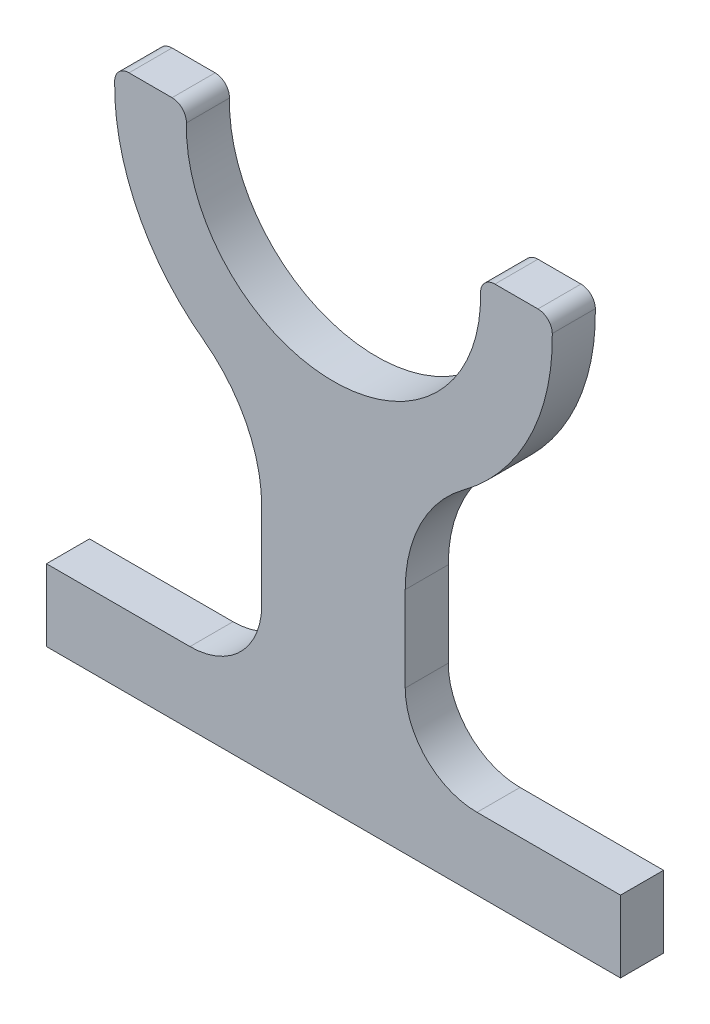
ISO-10303-21;
HEADER;
FILE_DESCRIPTION(('STEP AP214'),'2;1');
FILE_NAME('part.step','',(''),(''),'','','');
FILE_SCHEMA(('AUTOMOTIVE_DESIGN { 1 0 10303 214 1 1 1 1 }'));
ENDSEC;
DATA;
#1=APPLICATION_CONTEXT('core data for automotive mechanical design processes');
#2=APPLICATION_PROTOCOL_DEFINITION('international standard','automotive_design',2000,#1);
#3=PRODUCT_CONTEXT('',#1,'mechanical');
#4=PRODUCT('Part','Part','',(#3));
#5=PRODUCT_RELATED_PRODUCT_CATEGORY('part','',(#4));
#6=PRODUCT_DEFINITION_FORMATION('','',#4);
#7=PRODUCT_DEFINITION_CONTEXT('part definition',#1,'design');
#8=PRODUCT_DEFINITION('design','',#6,#7);
#9=PRODUCT_DEFINITION_SHAPE('','',#8);
#10=(LENGTH_UNIT() NAMED_UNIT(*) SI_UNIT(.MILLI.,.METRE.));
#11=(NAMED_UNIT(*) PLANE_ANGLE_UNIT() SI_UNIT($,.RADIAN.));
#12=(NAMED_UNIT(*) SI_UNIT($,.STERADIAN.) SOLID_ANGLE_UNIT());
#13=UNCERTAINTY_MEASURE_WITH_UNIT(LENGTH_MEASURE(1.E-05),#10,'distance_accuracy_value','');
#14=(GEOMETRIC_REPRESENTATION_CONTEXT(3) GLOBAL_UNCERTAINTY_ASSIGNED_CONTEXT((#13)) GLOBAL_UNIT_ASSIGNED_CONTEXT((#10,
#11,#12)) REPRESENTATION_CONTEXT('',''));
#15=CARTESIAN_POINT('',(0.,0.,0.));
#16=DIRECTION('',(0.,0.,1.));
#17=DIRECTION('',(1.,0.,0.));
#18=AXIS2_PLACEMENT_3D('',#15,#16,#17);
#19=CARTESIAN_POINT('',(-40.,10.,3.));
#20=DIRECTION('',(0.,-1.,0.));
#21=DIRECTION('',(0.,0.,-1.));
#22=AXIS2_PLACEMENT_3D('',#19,#20,#21);
#23=PLANE('',#22);
#24=DIRECTION('',(-1.,0.,0.));
#25=VECTOR('',#24,1.);
#26=CARTESIAN_POINT('',(-40.,10.,-3.));
#27=LINE('',#26,#25);
#28=CARTESIAN_POINT('',(-20.,10.,-3.));
#29=VERTEX_POINT('',#28);
#30=CARTESIAN_POINT('',(-40.,10.,-3.));
#31=VERTEX_POINT('',#30);
#32=EDGE_CURVE('E444',#29,#31,#27,.T.);
#33=ORIENTED_EDGE('',*,*,#32,.T.);
#34=DIRECTION('',(0.,0.,-1.));
#35=VECTOR('',#34,1.);
#36=CARTESIAN_POINT('',(-40.,10.,3.));
#37=LINE('',#36,#35);
#38=CARTESIAN_POINT('',(-40.,10.,3.));
#39=VERTEX_POINT('',#38);
#40=EDGE_CURVE('E12',#39,#31,#37,.T.);
#41=ORIENTED_EDGE('',*,*,#40,.F.);
#42=DIRECTION('',(-1.,0.,0.));
#43=VECTOR('',#42,1.);
#44=CARTESIAN_POINT('',(-40.,10.,3.));
#45=LINE('',#44,#43);
#46=CARTESIAN_POINT('',(-20.,10.,3.));
#47=VERTEX_POINT('',#46);
#48=EDGE_CURVE('E301',#47,#39,#45,.T.);
#49=ORIENTED_EDGE('',*,*,#48,.F.);
#50=DIRECTION('',(0.,0.,-1.));
#51=VECTOR('',#50,1.);
#52=CARTESIAN_POINT('',(-20.,10.,3.));
#53=LINE('',#52,#51);
#54=EDGE_CURVE('E213',#47,#29,#53,.T.);
#55=ORIENTED_EDGE('',*,*,#54,.T.);
#56=EDGE_LOOP('',(#33,#41,#49,#55));
#57=FACE_BOUND('',#56,.T.);
#58=ADVANCED_FACE('F43',(#57),#23,.F.);
#59=CARTESIAN_POINT('',(-40.,0.,3.));
#60=DIRECTION('',(1.,0.,0.));
#61=DIRECTION('',(0.,0.,-1.));
#62=AXIS2_PLACEMENT_3D('',#59,#60,#61);
#63=PLANE('',#62);
#64=DIRECTION('',(0.,-1.,0.));
#65=VECTOR('',#64,1.);
#66=CARTESIAN_POINT('',(-40.,0.,-3.));
#67=LINE('',#66,#65);
#68=CARTESIAN_POINT('',(-40.,0.,-3.));
#69=VERTEX_POINT('',#68);
#70=EDGE_CURVE('E431',#31,#69,#67,.T.);
#71=ORIENTED_EDGE('',*,*,#70,.T.);
#72=DIRECTION('',(0.,0.,-1.));
#73=VECTOR('',#72,1.);
#74=CARTESIAN_POINT('',(-40.,0.,3.));
#75=LINE('',#74,#73);
#76=CARTESIAN_POINT('',(-40.,0.,3.));
#77=VERTEX_POINT('',#76);
#78=EDGE_CURVE('E53',#77,#69,#75,.T.);
#79=ORIENTED_EDGE('',*,*,#78,.F.);
#80=DIRECTION('',(0.,-1.,0.));
#81=VECTOR('',#80,1.);
#82=CARTESIAN_POINT('',(-40.,0.,3.));
#83=LINE('',#82,#81);
#84=EDGE_CURVE('E140',#39,#77,#83,.T.);
#85=ORIENTED_EDGE('',*,*,#84,.F.);
#86=ORIENTED_EDGE('',*,*,#40,.T.);
#87=EDGE_LOOP('',(#71,#79,#85,#86));
#88=FACE_BOUND('',#87,.T.);
#89=ADVANCED_FACE('F449',(#88),#63,.F.);
#90=CARTESIAN_POINT('',(-40.,0.,3.));
#91=DIRECTION('',(0.,1.,0.));
#92=DIRECTION('',(-1.,0.,0.));
#93=AXIS2_PLACEMENT_3D('',#90,#91,#92);
#94=PLANE('',#93);
#95=DIRECTION('',(1.,0.,0.));
#96=VECTOR('',#95,1.);
#97=CARTESIAN_POINT('',(-40.,0.,-3.));
#98=LINE('',#97,#96);
#99=CARTESIAN_POINT('',(40.,0.,-3.));
#100=VERTEX_POINT('',#99);
#101=EDGE_CURVE('E422',#69,#100,#98,.T.);
#102=ORIENTED_EDGE('',*,*,#101,.T.);
#103=DIRECTION('',(0.,0.,-1.));
#104=VECTOR('',#103,1.);
#105=CARTESIAN_POINT('',(40.,0.,3.));
#106=LINE('',#105,#104);
#107=CARTESIAN_POINT('',(40.,0.,3.));
#108=VERTEX_POINT('',#107);
#109=EDGE_CURVE('E398',#108,#100,#106,.T.);
#110=ORIENTED_EDGE('',*,*,#109,.F.);
#111=DIRECTION('',(1.,0.,0.));
#112=VECTOR('',#111,1.);
#113=CARTESIAN_POINT('',(-40.,0.,3.));
#114=LINE('',#113,#112);
#115=EDGE_CURVE('E290',#77,#108,#114,.T.);
#116=ORIENTED_EDGE('',*,*,#115,.F.);
#117=ORIENTED_EDGE('',*,*,#78,.T.);
#118=EDGE_LOOP('',(#102,#110,#116,#117));
#119=FACE_BOUND('',#118,.T.);
#120=ADVANCED_FACE('F451',(#119),#94,.F.);
#121=CARTESIAN_POINT('',(40.,0.,3.));
#122=DIRECTION('',(-1.,0.,0.));
#123=DIRECTION('',(0.,0.,1.));
#124=AXIS2_PLACEMENT_3D('',#121,#122,#123);
#125=PLANE('',#124);
#126=DIRECTION('',(0.,1.,0.));
#127=VECTOR('',#126,1.);
#128=CARTESIAN_POINT('',(40.,0.,-3.));
#129=LINE('',#128,#127);
#130=CARTESIAN_POINT('',(40.,10.,-3.));
#131=VERTEX_POINT('',#130);
#132=EDGE_CURVE('E417',#100,#131,#129,.T.);
#133=ORIENTED_EDGE('',*,*,#132,.T.);
#134=DIRECTION('',(0.,0.,-1.));
#135=VECTOR('',#134,1.);
#136=CARTESIAN_POINT('',(40.,10.,3.));
#137=LINE('',#136,#135);
#138=CARTESIAN_POINT('',(40.,10.,3.));
#139=VERTEX_POINT('',#138);
#140=EDGE_CURVE('E393',#139,#131,#137,.T.);
#141=ORIENTED_EDGE('',*,*,#140,.F.);
#142=DIRECTION('',(0.,1.,0.));
#143=VECTOR('',#142,1.);
#144=CARTESIAN_POINT('',(40.,0.,3.));
#145=LINE('',#144,#143);
#146=EDGE_CURVE('E286',#108,#139,#145,.T.);
#147=ORIENTED_EDGE('',*,*,#146,.F.);
#148=ORIENTED_EDGE('',*,*,#109,.T.);
#149=EDGE_LOOP('',(#133,#141,#147,#148));
#150=FACE_BOUND('',#149,.T.);
#151=ADVANCED_FACE('F415',(#150),#125,.F.);
#152=CARTESIAN_POINT('',(40.,10.,3.));
#153=DIRECTION('',(0.,-1.,0.));
#154=DIRECTION('',(1.,0.,0.));
#155=AXIS2_PLACEMENT_3D('',#152,#153,#154);
#156=PLANE('',#155);
#157=DIRECTION('',(-1.,0.,0.));
#158=VECTOR('',#157,1.);
#159=CARTESIAN_POINT('',(40.,10.,-3.));
#160=LINE('',#159,#158);
#161=CARTESIAN_POINT('',(20.,10.,-3.));
#162=VERTEX_POINT('',#161);
#163=EDGE_CURVE('E424',#131,#162,#160,.T.);
#164=ORIENTED_EDGE('',*,*,#163,.T.);
#165=DIRECTION('',(0.,0.,-1.));
#166=VECTOR('',#165,1.);
#167=CARTESIAN_POINT('',(20.,10.,3.));
#168=LINE('',#167,#166);
#169=CARTESIAN_POINT('',(20.,10.,3.));
#170=VERTEX_POINT('',#169);
#171=EDGE_CURVE('E388',#170,#162,#168,.T.);
#172=ORIENTED_EDGE('',*,*,#171,.F.);
#173=DIRECTION('',(-1.,0.,0.));
#174=VECTOR('',#173,1.);
#175=CARTESIAN_POINT('',(40.,10.,3.));
#176=LINE('',#175,#174);
#177=EDGE_CURVE('E283',#139,#170,#176,.T.);
#178=ORIENTED_EDGE('',*,*,#177,.F.);
#179=ORIENTED_EDGE('',*,*,#140,.T.);
#180=EDGE_LOOP('',(#164,#172,#178,#179));
#181=FACE_BOUND('',#180,.T.);
#182=ADVANCED_FACE('F460',(#181),#156,.F.);
#183=CARTESIAN_POINT('',(20.,20.,3.));
#184=DIRECTION('',(0.,0.,-1.));
#185=DIRECTION('',(-1.,0.,0.));
#186=AXIS2_PLACEMENT_3D('',#183,#184,#185);
#187=CYLINDRICAL_SURFACE('',#186,10.);
#188=CARTESIAN_POINT('',(20.,20.,-3.));
#189=DIRECTION('',(0.,0.,-1.));
#190=DIRECTION('',(-1.,0.,0.));
#191=AXIS2_PLACEMENT_3D('',#188,#189,#190);
#192=CIRCLE('',#191,10.);
#193=CARTESIAN_POINT('',(10.,20.,-3.));
#194=VERTEX_POINT('',#193);
#195=EDGE_CURVE('E429',#162,#194,#192,.T.);
#196=ORIENTED_EDGE('',*,*,#195,.T.);
#197=DIRECTION('',(0.,0.,-1.));
#198=VECTOR('',#197,1.);
#199=CARTESIAN_POINT('',(10.,20.,3.));
#200=LINE('',#199,#198);
#201=CARTESIAN_POINT('',(10.,20.,3.));
#202=VERTEX_POINT('',#201);
#203=EDGE_CURVE('E384',#202,#194,#200,.T.);
#204=ORIENTED_EDGE('',*,*,#203,.F.);
#205=CARTESIAN_POINT('',(20.,20.,3.));
#206=DIRECTION('',(0.,0.,-1.));
#207=DIRECTION('',(-1.,0.,0.));
#208=AXIS2_PLACEMENT_3D('',#205,#206,#207);
#209=CIRCLE('',#208,10.);
#210=EDGE_CURVE('E275',#170,#202,#209,.T.);
#211=ORIENTED_EDGE('',*,*,#210,.F.);
#212=ORIENTED_EDGE('',*,*,#171,.T.);
#213=EDGE_LOOP('',(#196,#204,#211,#212));
#214=FACE_BOUND('',#213,.T.);
#215=ADVANCED_FACE('F463',(#214),#187,.F.);
#216=CARTESIAN_POINT('',(10.,20.,3.));
#217=DIRECTION('',(-1.,0.,0.));
#218=DIRECTION('',(0.,-1.,0.));
#219=AXIS2_PLACEMENT_3D('',#216,#217,#218);
#220=PLANE('',#219);
#221=DIRECTION('',(0.,1.,0.));
#222=VECTOR('',#221,1.);
#223=CARTESIAN_POINT('',(10.,20.,-3.));
#224=LINE('',#223,#222);
#225=CARTESIAN_POINT('',(10.,31.876730806101,-3.));
#226=VERTEX_POINT('',#225);
#227=EDGE_CURVE('E734',#194,#226,#224,.T.);
#228=ORIENTED_EDGE('',*,*,#227,.T.);
#229=DIRECTION('',(0.,0.,-1.));
#230=VECTOR('',#229,1.);
#231=CARTESIAN_POINT('',(10.,31.876730806101,3.));
#232=LINE('',#231,#230);
#233=CARTESIAN_POINT('',(10.,31.876730806101,3.));
#234=VERTEX_POINT('',#233);
#235=EDGE_CURVE('E376',#234,#226,#232,.T.);
#236=ORIENTED_EDGE('',*,*,#235,.F.);
#237=DIRECTION('',(0.,1.,0.));
#238=VECTOR('',#237,1.);
#239=CARTESIAN_POINT('',(10.,20.,3.));
#240=LINE('',#239,#238);
#241=EDGE_CURVE('E271',#202,#234,#240,.T.);
#242=ORIENTED_EDGE('',*,*,#241,.F.);
#243=ORIENTED_EDGE('',*,*,#203,.T.);
#244=EDGE_LOOP('',(#228,#236,#242,#243));
#245=FACE_BOUND('',#244,.T.);
#246=ADVANCED_FACE('F467',(#245),#220,.F.);
#247=CARTESIAN_POINT('',(30.,31.876730806101,3.));
#248=DIRECTION('',(0.,0.,-1.));
#249=DIRECTION('',(-1.,0.,0.));
#250=AXIS2_PLACEMENT_3D('',#247,#248,#249);
#251=CYLINDRICAL_SURFACE('',#250,20.);
#252=CARTESIAN_POINT('',(30.,31.876730806101,-3.));
#253=DIRECTION('',(0.,0.,-1.));
#254=DIRECTION('',(-1.,0.,0.));
#255=AXIS2_PLACEMENT_3D('',#252,#253,#254);
#256=CIRCLE('',#255,20.);
#257=CARTESIAN_POINT('',(18.1188118811881,47.9651542492294,-3.));
#258=VERTEX_POINT('',#257);
#259=EDGE_CURVE('E731',#226,#258,#256,.T.);
#260=ORIENTED_EDGE('',*,*,#259,.T.);
#261=DIRECTION('',(0.,0.,-1.));
#262=VECTOR('',#261,1.);
#263=CARTESIAN_POINT('',(18.1188118811881,47.9651542492294,3.));
#264=LINE('',#263,#262);
#265=CARTESIAN_POINT('',(18.1188118811881,47.9651542492294,3.));
#266=VERTEX_POINT('',#265);
#267=EDGE_CURVE('E371',#266,#258,#264,.T.);
#268=ORIENTED_EDGE('',*,*,#267,.F.);
#269=CARTESIAN_POINT('',(30.,31.876730806101,3.));
#270=DIRECTION('',(0.,0.,-1.));
#271=DIRECTION('',(-1.,0.,0.));
#272=AXIS2_PLACEMENT_3D('',#269,#270,#271);
#273=CIRCLE('',#272,20.);
#274=EDGE_CURVE('E267',#234,#266,#273,.T.);
#275=ORIENTED_EDGE('',*,*,#274,.F.);
#276=ORIENTED_EDGE('',*,*,#235,.T.);
#277=EDGE_LOOP('',(#260,#268,#275,#276));
#278=FACE_BOUND('',#277,.T.);
#279=ADVANCED_FACE('F471',(#278),#251,.F.);
#280=CARTESIAN_POINT('',(0.,72.5,3.));
#281=DIRECTION('',(0.,0.,-1.));
#282=DIRECTION('',(-1.,0.,0.));
#283=AXIS2_PLACEMENT_3D('',#280,#281,#282);
#284=CYLINDRICAL_SURFACE('',#283,30.4999999999998);
#285=CARTESIAN_POINT('',(0.,72.5,-3.));
#286=DIRECTION('',(0.,0.,1.));
#287=DIRECTION('',(1.,0.,0.));
#288=AXIS2_PLACEMENT_3D('',#285,#286,#287);
#289=CIRCLE('',#288,30.4999999999998);
#290=CARTESIAN_POINT('',(30.4953058868516,73.0350877192982,-3.));
#291=VERTEX_POINT('',#290);
#292=EDGE_CURVE('E724',#258,#291,#289,.T.);
#293=ORIENTED_EDGE('',*,*,#292,.T.);
#294=DIRECTION('',(0.,0.,-1.));
#295=VECTOR('',#294,1.);
#296=CARTESIAN_POINT('',(30.4953058868516,73.0350877192982,3.));
#297=LINE('',#296,#295);
#298=CARTESIAN_POINT('',(30.4953058868516,73.0350877192982,3.));
#299=VERTEX_POINT('',#298);
#300=EDGE_CURVE('E366',#299,#291,#297,.T.);
#301=ORIENTED_EDGE('',*,*,#300,.F.);
#302=CARTESIAN_POINT('',(0.,72.5,3.));
#303=DIRECTION('',(0.,0.,1.));
#304=DIRECTION('',(1.,0.,0.));
#305=AXIS2_PLACEMENT_3D('',#302,#303,#304);
#306=CIRCLE('',#305,30.4999999999998);
#307=EDGE_CURVE('E264',#266,#299,#306,.T.);
#308=ORIENTED_EDGE('',*,*,#307,.F.);
#309=ORIENTED_EDGE('',*,*,#267,.T.);
#310=EDGE_LOOP('',(#293,#301,#308,#309));
#311=FACE_BOUND('',#310,.T.);
#312=ADVANCED_FACE('F475',(#311),#284,.T.);
#313=CARTESIAN_POINT('',(28.4956136975498,73.,3.));
#314=DIRECTION('',(0.,0.,-1.));
#315=DIRECTION('',(-1.,0.,0.));
#316=AXIS2_PLACEMENT_3D('',#313,#314,#315);
#317=CYLINDRICAL_SURFACE('',#316,2.);
#318=CARTESIAN_POINT('',(28.4956136975498,73.,-3.));
#319=DIRECTION('',(0.,0.,1.));
#320=DIRECTION('',(1.,0.,0.));
#321=AXIS2_PLACEMENT_3D('',#318,#319,#320);
#322=CIRCLE('',#321,2.);
#323=CARTESIAN_POINT('',(28.4956136975498,75.,-3.));
#324=VERTEX_POINT('',#323);
#325=EDGE_CURVE('E720',#291,#324,#322,.T.);
#326=ORIENTED_EDGE('',*,*,#325,.T.);
#327=DIRECTION('',(0.,0.,-1.));
#328=VECTOR('',#327,1.);
#329=CARTESIAN_POINT('',(28.4956136975498,75.,3.));
#330=LINE('',#329,#328);
#331=CARTESIAN_POINT('',(28.4956136975498,75.,3.));
#332=VERTEX_POINT('',#331);
#333=EDGE_CURVE('E362',#332,#324,#330,.T.);
#334=ORIENTED_EDGE('',*,*,#333,.F.);
#335=CARTESIAN_POINT('',(28.4956136975498,73.,3.));
#336=DIRECTION('',(0.,0.,1.));
#337=DIRECTION('',(1.,0.,0.));
#338=AXIS2_PLACEMENT_3D('',#335,#336,#337);
#339=CIRCLE('',#338,2.);
#340=EDGE_CURVE('E256',#299,#332,#339,.T.);
#341=ORIENTED_EDGE('',*,*,#340,.F.);
#342=ORIENTED_EDGE('',*,*,#300,.T.);
#343=EDGE_LOOP('',(#326,#334,#341,#342));
#344=FACE_BOUND('',#343,.T.);
#345=ADVANCED_FACE('F479',(#344),#317,.T.);
#346=CARTESIAN_POINT('',(28.4956136975498,75.,3.));
#347=DIRECTION('',(0.,-1.,0.));
#348=DIRECTION('',(0.,0.,-1.));
#349=AXIS2_PLACEMENT_3D('',#346,#347,#348);
#350=PLANE('',#349);
#351=DIRECTION('',(-1.,0.,0.));
#352=VECTOR('',#351,1.);
#353=CARTESIAN_POINT('',(28.4956136975498,75.,-3.));
#354=LINE('',#353,#352);
#355=CARTESIAN_POINT('',(22.494443758404,75.,-3.));
#356=VERTEX_POINT('',#355);
#357=EDGE_CURVE('E716',#324,#356,#354,.T.);
#358=ORIENTED_EDGE('',*,*,#357,.T.);
#359=DIRECTION('',(0.,0.,-1.));
#360=VECTOR('',#359,1.);
#361=CARTESIAN_POINT('',(22.494443758404,75.,3.));
#362=LINE('',#361,#360);
#363=CARTESIAN_POINT('',(22.494443758404,75.,3.));
#364=VERTEX_POINT('',#363);
#365=EDGE_CURVE('E354',#364,#356,#362,.T.);
#366=ORIENTED_EDGE('',*,*,#365,.F.);
#367=DIRECTION('',(-1.,0.,0.));
#368=VECTOR('',#367,1.);
#369=CARTESIAN_POINT('',(28.4956136975498,75.,3.));
#370=LINE('',#369,#368);
#371=EDGE_CURVE('E252',#332,#364,#370,.T.);
#372=ORIENTED_EDGE('',*,*,#371,.F.);
#373=ORIENTED_EDGE('',*,*,#333,.T.);
#374=EDGE_LOOP('',(#358,#366,#372,#373));
#375=FACE_BOUND('',#374,.T.);
#376=ADVANCED_FACE('F483',(#375),#350,.F.);
#377=CARTESIAN_POINT('',(22.494443758404,73.,3.));
#378=DIRECTION('',(0.,0.,-1.));
#379=DIRECTION('',(-1.,0.,0.));
#380=AXIS2_PLACEMENT_3D('',#377,#378,#379);
#381=CYLINDRICAL_SURFACE('',#380,2.);
#382=CARTESIAN_POINT('',(22.494443758404,73.,-3.));
#383=DIRECTION('',(0.,0.,1.));
#384=DIRECTION('',(1.,0.,0.));
#385=AXIS2_PLACEMENT_3D('',#382,#383,#384);
#386=CIRCLE('',#385,2.);
#387=CARTESIAN_POINT('',(20.4949376465459,72.9555555555556,-3.));
#388=VERTEX_POINT('',#387);
#389=EDGE_CURVE('E713',#356,#388,#386,.T.);
#390=ORIENTED_EDGE('',*,*,#389,.T.);
#391=DIRECTION('',(0.,0.,-1.));
#392=VECTOR('',#391,1.);
#393=CARTESIAN_POINT('',(20.4949376465459,72.9555555555556,3.));
#394=LINE('',#393,#392);
#395=CARTESIAN_POINT('',(20.4949376465459,72.9555555555556,3.));
#396=VERTEX_POINT('',#395);
#397=EDGE_CURVE('E349',#396,#388,#394,.T.);
#398=ORIENTED_EDGE('',*,*,#397,.F.);
#399=CARTESIAN_POINT('',(22.494443758404,73.,3.));
#400=DIRECTION('',(0.,0.,1.));
#401=DIRECTION('',(1.,0.,0.));
#402=AXIS2_PLACEMENT_3D('',#399,#400,#401);
#403=CIRCLE('',#402,2.);
#404=EDGE_CURVE('E248',#364,#396,#403,.T.);
#405=ORIENTED_EDGE('',*,*,#404,.F.);
#406=ORIENTED_EDGE('',*,*,#365,.T.);
#407=EDGE_LOOP('',(#390,#398,#405,#406));
#408=FACE_BOUND('',#407,.T.);
#409=ADVANCED_FACE('F487',(#408),#381,.T.);
#410=CARTESIAN_POINT('',(0.,72.5,3.));
#411=DIRECTION('',(0.,0.,-1.));
#412=DIRECTION('',(-1.,0.,0.));
#413=AXIS2_PLACEMENT_3D('',#410,#411,#412);
#414=CYLINDRICAL_SURFACE('',#413,20.5);
#415=CARTESIAN_POINT('',(0.,72.5,-3.));
#416=DIRECTION('',(0.,0.,-1.));
#417=DIRECTION('',(1.,0.,0.));
#418=AXIS2_PLACEMENT_3D('',#415,#416,#417);
#419=CIRCLE('',#418,20.5);
#420=CARTESIAN_POINT('',(-20.4949376465459,72.9555555555555,-3.));
#421=VERTEX_POINT('',#420);
#422=EDGE_CURVE('E705',#388,#421,#419,.T.);
#423=ORIENTED_EDGE('',*,*,#422,.T.);
#424=DIRECTION('',(0.,0.,-1.));
#425=VECTOR('',#424,1.);
#426=CARTESIAN_POINT('',(-20.4949376465459,72.9555555555555,3.));
#427=LINE('',#426,#425);
#428=CARTESIAN_POINT('',(-20.4949376465459,72.9555555555555,3.));
#429=VERTEX_POINT('',#428);
#430=EDGE_CURVE('E344',#429,#421,#427,.T.);
#431=ORIENTED_EDGE('',*,*,#430,.F.);
#432=CARTESIAN_POINT('',(0.,72.5,3.));
#433=DIRECTION('',(0.,0.,-1.));
#434=DIRECTION('',(1.,0.,0.));
#435=AXIS2_PLACEMENT_3D('',#432,#433,#434);
#436=CIRCLE('',#435,20.5);
#437=EDGE_CURVE('E245',#396,#429,#436,.T.);
#438=ORIENTED_EDGE('',*,*,#437,.F.);
#439=ORIENTED_EDGE('',*,*,#397,.T.);
#440=EDGE_LOOP('',(#423,#431,#438,#439));
#441=FACE_BOUND('',#440,.T.);
#442=ADVANCED_FACE('F491',(#441),#414,.F.);
#443=CARTESIAN_POINT('',(-22.494443758404,73.,3.));
#444=DIRECTION('',(0.,0.,-1.));
#445=DIRECTION('',(-1.,0.,0.));
#446=AXIS2_PLACEMENT_3D('',#443,#444,#445);
#447=CYLINDRICAL_SURFACE('',#446,2.);
#448=CARTESIAN_POINT('',(-22.494443758404,73.,-3.));
#449=DIRECTION('',(0.,0.,1.));
#450=DIRECTION('',(1.,0.,0.));
#451=AXIS2_PLACEMENT_3D('',#448,#449,#450);
#452=CIRCLE('',#451,2.);
#453=CARTESIAN_POINT('',(-22.494443758404,75.,-3.));
#454=VERTEX_POINT('',#453);
#455=EDGE_CURVE('E701',#421,#454,#452,.T.);
#456=ORIENTED_EDGE('',*,*,#455,.T.);
#457=DIRECTION('',(0.,0.,-1.));
#458=VECTOR('',#457,1.);
#459=CARTESIAN_POINT('',(-22.494443758404,75.,3.));
#460=LINE('',#459,#458);
#461=CARTESIAN_POINT('',(-22.494443758404,75.,3.));
#462=VERTEX_POINT('',#461);
#463=EDGE_CURVE('E340',#462,#454,#460,.T.);
#464=ORIENTED_EDGE('',*,*,#463,.F.);
#465=CARTESIAN_POINT('',(-22.494443758404,73.,3.));
#466=DIRECTION('',(0.,0.,1.));
#467=DIRECTION('',(1.,0.,0.));
#468=AXIS2_PLACEMENT_3D('',#465,#466,#467);
#469=CIRCLE('',#468,2.);
#470=EDGE_CURVE('E237',#429,#462,#469,.T.);
#471=ORIENTED_EDGE('',*,*,#470,.F.);
#472=ORIENTED_EDGE('',*,*,#430,.T.);
#473=EDGE_LOOP('',(#456,#464,#471,#472));
#474=FACE_BOUND('',#473,.T.);
#475=ADVANCED_FACE('F495',(#474),#447,.T.);
#476=CARTESIAN_POINT('',(-22.494443758404,75.,3.));
#477=DIRECTION('',(0.,-1.,0.));
#478=DIRECTION('',(0.,0.,-1.));
#479=AXIS2_PLACEMENT_3D('',#476,#477,#478);
#480=PLANE('',#479);
#481=DIRECTION('',(-1.,0.,0.));
#482=VECTOR('',#481,1.);
#483=CARTESIAN_POINT('',(-22.494443758404,75.,-3.));
#484=LINE('',#483,#482);
#485=CARTESIAN_POINT('',(-28.4956136975498,75.,-3.));
#486=VERTEX_POINT('',#485);
#487=EDGE_CURVE('E697',#454,#486,#484,.T.);
#488=ORIENTED_EDGE('',*,*,#487,.T.);
#489=DIRECTION('',(0.,0.,-1.));
#490=VECTOR('',#489,1.);
#491=CARTESIAN_POINT('',(-28.4956136975498,75.,3.));
#492=LINE('',#491,#490);
#493=CARTESIAN_POINT('',(-28.4956136975498,75.,3.));
#494=VERTEX_POINT('',#493);
#495=EDGE_CURVE('E332',#494,#486,#492,.T.);
#496=ORIENTED_EDGE('',*,*,#495,.F.);
#497=DIRECTION('',(-1.,0.,0.));
#498=VECTOR('',#497,1.);
#499=CARTESIAN_POINT('',(-22.494443758404,75.,3.));
#500=LINE('',#499,#498);
#501=EDGE_CURVE('E233',#462,#494,#500,.T.);
#502=ORIENTED_EDGE('',*,*,#501,.F.);
#503=ORIENTED_EDGE('',*,*,#463,.T.);
#504=EDGE_LOOP('',(#488,#496,#502,#503));
#505=FACE_BOUND('',#504,.T.);
#506=ADVANCED_FACE('F499',(#505),#480,.F.);
#507=CARTESIAN_POINT('',(-28.4956136975498,73.,3.));
#508=DIRECTION('',(0.,0.,-1.));
#509=DIRECTION('',(-1.,0.,0.));
#510=AXIS2_PLACEMENT_3D('',#507,#508,#509);
#511=CYLINDRICAL_SURFACE('',#510,2.);
#512=CARTESIAN_POINT('',(-28.4956136975498,73.,-3.));
#513=DIRECTION('',(0.,0.,1.));
#514=DIRECTION('',(-1.,0.,0.));
#515=AXIS2_PLACEMENT_3D('',#512,#513,#514);
#516=CIRCLE('',#515,2.);
#517=CARTESIAN_POINT('',(-30.4953058868516,73.0350877192982,-3.));
#518=VERTEX_POINT('',#517);
#519=EDGE_CURVE('E683',#486,#518,#516,.T.);
#520=ORIENTED_EDGE('',*,*,#519,.T.);
#521=DIRECTION('',(0.,0.,-1.));
#522=VECTOR('',#521,1.);
#523=CARTESIAN_POINT('',(-30.4953058868516,73.0350877192982,3.));
#524=LINE('',#523,#522);
#525=CARTESIAN_POINT('',(-30.4953058868516,73.0350877192982,3.));
#526=VERTEX_POINT('',#525);
#527=EDGE_CURVE('E327',#526,#518,#524,.T.);
#528=ORIENTED_EDGE('',*,*,#527,.F.);
#529=CARTESIAN_POINT('',(-28.4956136975498,73.,3.));
#530=DIRECTION('',(0.,0.,1.));
#531=DIRECTION('',(-1.,0.,0.));
#532=AXIS2_PLACEMENT_3D('',#529,#530,#531);
#533=CIRCLE('',#532,2.);
#534=EDGE_CURVE('E229',#494,#526,#533,.T.);
#535=ORIENTED_EDGE('',*,*,#534,.F.);
#536=ORIENTED_EDGE('',*,*,#495,.T.);
#537=EDGE_LOOP('',(#520,#528,#535,#536));
#538=FACE_BOUND('',#537,.T.);
#539=ADVANCED_FACE('F503',(#538),#511,.T.);
#540=CARTESIAN_POINT('',(0.,72.5,3.));
#541=DIRECTION('',(0.,0.,-1.));
#542=DIRECTION('',(-1.,0.,0.));
#543=AXIS2_PLACEMENT_3D('',#540,#541,#542);
#544=CYLINDRICAL_SURFACE('',#543,30.4999999999998);
#545=CARTESIAN_POINT('',(0.,72.5,-3.));
#546=DIRECTION('',(0.,0.,1.));
#547=DIRECTION('',(-1.,0.,0.));
#548=AXIS2_PLACEMENT_3D('',#545,#546,#547);
#549=CIRCLE('',#548,30.4999999999998);
#550=CARTESIAN_POINT('',(-18.1188118811881,47.9651542492294,-3.));
#551=VERTEX_POINT('',#550);
#552=EDGE_CURVE('E679',#518,#551,#549,.T.);
#553=ORIENTED_EDGE('',*,*,#552,.T.);
#554=DIRECTION('',(0.,0.,-1.));
#555=VECTOR('',#554,1.);
#556=CARTESIAN_POINT('',(-18.1188118811881,47.9651542492294,3.));
#557=LINE('',#556,#555);
#558=CARTESIAN_POINT('',(-18.1188118811881,47.9651542492294,3.));
#559=VERTEX_POINT('',#558);
#560=EDGE_CURVE('E206',#559,#551,#557,.T.);
#561=ORIENTED_EDGE('',*,*,#560,.F.);
#562=CARTESIAN_POINT('',(0.,72.5,3.));
#563=DIRECTION('',(0.,0.,1.));
#564=DIRECTION('',(-1.,0.,0.));
#565=AXIS2_PLACEMENT_3D('',#562,#563,#564);
#566=CIRCLE('',#565,30.4999999999998);
#567=EDGE_CURVE('E195',#526,#559,#566,.T.);
#568=ORIENTED_EDGE('',*,*,#567,.F.);
#569=ORIENTED_EDGE('',*,*,#527,.T.);
#570=EDGE_LOOP('',(#553,#561,#568,#569));
#571=FACE_BOUND('',#570,.T.);
#572=ADVANCED_FACE('F507',(#571),#544,.T.);
#573=CARTESIAN_POINT('',(-30.,31.876730806101,3.));
#574=DIRECTION('',(0.,0.,-1.));
#575=DIRECTION('',(-1.,0.,0.));
#576=AXIS2_PLACEMENT_3D('',#573,#574,#575);
#577=CYLINDRICAL_SURFACE('',#576,20.);
#578=CARTESIAN_POINT('',(-30.,31.876730806101,-3.));
#579=DIRECTION('',(0.,0.,-1.));
#580=DIRECTION('',(1.,0.,0.));
#581=AXIS2_PLACEMENT_3D('',#578,#579,#580);
#582=CIRCLE('',#581,20.);
#583=CARTESIAN_POINT('',(-10.,31.876730806101,-3.));
#584=VERTEX_POINT('',#583);
#585=EDGE_CURVE('E204',#551,#584,#582,.T.);
#586=ORIENTED_EDGE('',*,*,#585,.T.);
#587=DIRECTION('',(0.,0.,-1.));
#588=VECTOR('',#587,1.);
#589=CARTESIAN_POINT('',(-10.,31.876730806101,3.));
#590=LINE('',#589,#588);
#591=CARTESIAN_POINT('',(-10.,31.876730806101,3.));
#592=VERTEX_POINT('',#591);
#593=EDGE_CURVE('E201',#592,#584,#590,.T.);
#594=ORIENTED_EDGE('',*,*,#593,.F.);
#595=CARTESIAN_POINT('',(-30.,31.876730806101,3.));
#596=DIRECTION('',(0.,0.,-1.));
#597=DIRECTION('',(1.,0.,0.));
#598=AXIS2_PLACEMENT_3D('',#595,#596,#597);
#599=CIRCLE('',#598,20.);
#600=EDGE_CURVE('E189',#559,#592,#599,.T.);
#601=ORIENTED_EDGE('',*,*,#600,.F.);
#602=ORIENTED_EDGE('',*,*,#560,.T.);
#603=EDGE_LOOP('',(#586,#594,#601,#602));
#604=FACE_BOUND('',#603,.T.);
#605=ADVANCED_FACE('F202',(#604),#577,.F.);
#606=CARTESIAN_POINT('',(-9.99999999999999,20.,3.));
#607=DIRECTION('',(1.,0.,0.));
#608=DIRECTION('',(0.,1.,0.));
#609=AXIS2_PLACEMENT_3D('',#606,#607,#608);
#610=PLANE('',#609);
#611=DIRECTION('',(0.,-1.,0.));
#612=VECTOR('',#611,1.);
#613=CARTESIAN_POINT('',(-9.99999999999999,20.,-3.));
#614=LINE('',#613,#612);
#615=CARTESIAN_POINT('',(-9.99999999999999,20.,-3.));
#616=VERTEX_POINT('',#615);
#617=EDGE_CURVE('E126',#584,#616,#614,.T.);
#618=ORIENTED_EDGE('',*,*,#617,.T.);
#619=DIRECTION('',(0.,0.,-1.));
#620=VECTOR('',#619,1.);
#621=CARTESIAN_POINT('',(-9.99999999999999,20.,3.));
#622=LINE('',#621,#620);
#623=CARTESIAN_POINT('',(-9.99999999999999,20.,3.));
#624=VERTEX_POINT('',#623);
#625=EDGE_CURVE('E207',#624,#616,#622,.T.);
#626=ORIENTED_EDGE('',*,*,#625,.F.);
#627=DIRECTION('',(0.,-1.,0.));
#628=VECTOR('',#627,1.);
#629=CARTESIAN_POINT('',(-9.99999999999999,20.,3.));
#630=LINE('',#629,#628);
#631=EDGE_CURVE('E193',#592,#624,#630,.T.);
#632=ORIENTED_EDGE('',*,*,#631,.F.);
#633=ORIENTED_EDGE('',*,*,#593,.T.);
#634=EDGE_LOOP('',(#618,#626,#632,#633));
#635=FACE_BOUND('',#634,.T.);
#636=ADVANCED_FACE('F209',(#635),#610,.F.);
#637=CARTESIAN_POINT('',(-20.,20.,3.));
#638=DIRECTION('',(0.,0.,-1.));
#639=DIRECTION('',(-1.,0.,0.));
#640=AXIS2_PLACEMENT_3D('',#637,#638,#639);
#641=CYLINDRICAL_SURFACE('',#640,10.);
#642=CARTESIAN_POINT('',(-20.,20.,-3.));
#643=DIRECTION('',(0.,0.,-1.));
#644=DIRECTION('',(1.,0.,0.));
#645=AXIS2_PLACEMENT_3D('',#642,#643,#644);
#646=CIRCLE('',#645,10.);
#647=EDGE_CURVE('E132',#616,#29,#646,.T.);
#648=ORIENTED_EDGE('',*,*,#647,.T.);
#649=ORIENTED_EDGE('',*,*,#54,.F.);
#650=CARTESIAN_POINT('',(-20.,20.,3.));
#651=DIRECTION('',(0.,0.,-1.));
#652=DIRECTION('',(1.,0.,0.));
#653=AXIS2_PLACEMENT_3D('',#650,#651,#652);
#654=CIRCLE('',#653,10.);
#655=EDGE_CURVE('E61',#624,#47,#654,.T.);
#656=ORIENTED_EDGE('',*,*,#655,.F.);
#657=ORIENTED_EDGE('',*,*,#625,.T.);
#658=EDGE_LOOP('',(#648,#649,#656,#657));
#659=FACE_BOUND('',#658,.T.);
#660=ADVANCED_FACE('F516',(#659),#641,.F.);
#661=CARTESIAN_POINT('',(-20.,20.,3.));
#662=DIRECTION('',(0.,0.,1.));
#663=DIRECTION('',(1.,0.,0.));
#664=AXIS2_PLACEMENT_3D('',#661,#662,#663);
#665=PLANE('',#664);
#666=ORIENTED_EDGE('',*,*,#48,.T.);
#667=ORIENTED_EDGE('',*,*,#84,.T.);
#668=ORIENTED_EDGE('',*,*,#115,.T.);
#669=ORIENTED_EDGE('',*,*,#146,.T.);
#670=ORIENTED_EDGE('',*,*,#177,.T.);
#671=ORIENTED_EDGE('',*,*,#210,.T.);
#672=ORIENTED_EDGE('',*,*,#241,.T.);
#673=ORIENTED_EDGE('',*,*,#274,.T.);
#674=ORIENTED_EDGE('',*,*,#307,.T.);
#675=ORIENTED_EDGE('',*,*,#340,.T.);
#676=ORIENTED_EDGE('',*,*,#371,.T.);
#677=ORIENTED_EDGE('',*,*,#404,.T.);
#678=ORIENTED_EDGE('',*,*,#437,.T.);
#679=ORIENTED_EDGE('',*,*,#470,.T.);
#680=ORIENTED_EDGE('',*,*,#501,.T.);
#681=ORIENTED_EDGE('',*,*,#534,.T.);
#682=ORIENTED_EDGE('',*,*,#567,.T.);
#683=ORIENTED_EDGE('',*,*,#600,.T.);
#684=ORIENTED_EDGE('',*,*,#631,.T.);
#685=ORIENTED_EDGE('',*,*,#655,.T.);
#686=EDGE_LOOP('',(#666,#667,#668,#669,#670,#671,#672,#673,#674,#675,#676,#677,#678,#679,#680,
#681,#682,#683,#684,#685));
#687=FACE_BOUND('',#686,.T.);
#688=ADVANCED_FACE('F191',(#687),#665,.T.);
#689=CARTESIAN_POINT('',(-20.,20.,-3.));
#690=DIRECTION('',(0.,0.,1.));
#691=DIRECTION('',(1.,0.,0.));
#692=AXIS2_PLACEMENT_3D('',#689,#690,#691);
#693=PLANE('',#692);
#694=ORIENTED_EDGE('',*,*,#32,.F.);
#695=ORIENTED_EDGE('',*,*,#647,.F.);
#696=ORIENTED_EDGE('',*,*,#617,.F.);
#697=ORIENTED_EDGE('',*,*,#585,.F.);
#698=ORIENTED_EDGE('',*,*,#552,.F.);
#699=ORIENTED_EDGE('',*,*,#519,.F.);
#700=ORIENTED_EDGE('',*,*,#487,.F.);
#701=ORIENTED_EDGE('',*,*,#455,.F.);
#702=ORIENTED_EDGE('',*,*,#422,.F.);
#703=ORIENTED_EDGE('',*,*,#389,.F.);
#704=ORIENTED_EDGE('',*,*,#357,.F.);
#705=ORIENTED_EDGE('',*,*,#325,.F.);
#706=ORIENTED_EDGE('',*,*,#292,.F.);
#707=ORIENTED_EDGE('',*,*,#259,.F.);
#708=ORIENTED_EDGE('',*,*,#227,.F.);
#709=ORIENTED_EDGE('',*,*,#195,.F.);
#710=ORIENTED_EDGE('',*,*,#163,.F.);
#711=ORIENTED_EDGE('',*,*,#132,.F.);
#712=ORIENTED_EDGE('',*,*,#101,.F.);
#713=ORIENTED_EDGE('',*,*,#70,.F.);
#714=EDGE_LOOP('',(#694,#695,#696,#697,#698,#699,#700,#701,#702,#703,#704,#705,#706,#707,#708,
#709,#710,#711,#712,#713));
#715=FACE_BOUND('',#714,.T.);
#716=ADVANCED_FACE('F421',(#715),#693,.F.);
#717=CLOSED_SHELL('',(#58,#89,#120,#151,#182,#215,#246,#279,#312,#345,#376,#409,#442,#475,#506,
#539,#572,#605,#636,#660,#688,#716));
#718=MANIFOLD_SOLID_BREP('B2',#717);
#719=ADVANCED_BREP_SHAPE_REPRESENTATION('',(#18,#718),#14);
#720=SHAPE_DEFINITION_REPRESENTATION(#9,#719);
ENDSEC;
END-ISO-10303-21;
